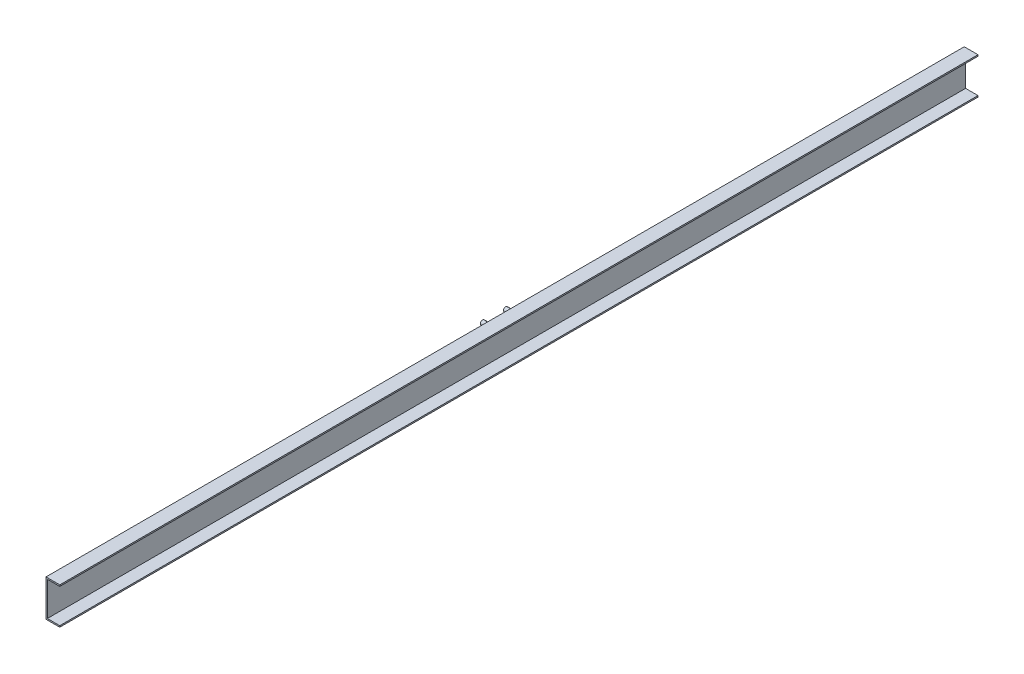
ISO-10303-21;
HEADER;
FILE_DESCRIPTION(('STEP AP214'),'2;1');
FILE_NAME('part.step','',(''),(''),'','','');
FILE_SCHEMA(('AUTOMOTIVE_DESIGN { 1 0 10303 214 1 1 1 1 }'));
ENDSEC;
DATA;
#1=APPLICATION_CONTEXT('core data for automotive mechanical design processes');
#2=APPLICATION_PROTOCOL_DEFINITION('international standard','automotive_design',2000,#1);
#3=PRODUCT_CONTEXT('',#1,'mechanical');
#4=PRODUCT('Part','Part','',(#3));
#5=PRODUCT_RELATED_PRODUCT_CATEGORY('part','',(#4));
#6=PRODUCT_DEFINITION_FORMATION('','',#4);
#7=PRODUCT_DEFINITION_CONTEXT('part definition',#1,'design');
#8=PRODUCT_DEFINITION('design','',#6,#7);
#9=PRODUCT_DEFINITION_SHAPE('','',#8);
#10=(LENGTH_UNIT() NAMED_UNIT(*) SI_UNIT(.MILLI.,.METRE.));
#11=(NAMED_UNIT(*) PLANE_ANGLE_UNIT() SI_UNIT($,.RADIAN.));
#12=(NAMED_UNIT(*) SI_UNIT($,.STERADIAN.) SOLID_ANGLE_UNIT());
#13=UNCERTAINTY_MEASURE_WITH_UNIT(LENGTH_MEASURE(1.E-05),#10,'distance_accuracy_value','');
#14=(GEOMETRIC_REPRESENTATION_CONTEXT(3) GLOBAL_UNCERTAINTY_ASSIGNED_CONTEXT((#13)) GLOBAL_UNIT_ASSIGNED_CONTEXT((#10,
#11,#12)) REPRESENTATION_CONTEXT('',''));
#15=CARTESIAN_POINT('',(0.,0.,0.));
#16=DIRECTION('',(0.,0.,1.));
#17=DIRECTION('',(1.,0.,0.));
#18=AXIS2_PLACEMENT_3D('',#15,#16,#17);
#19=CARTESIAN_POINT('',(0.,0.,3500.));
#20=DIRECTION('',(0.,1.,0.));
#21=DIRECTION('',(0.,0.,1.));
#22=AXIS2_PLACEMENT_3D('',#19,#20,#21);
#23=PLANE('',#22);
#24=DIRECTION('',(0.,0.,-1.));
#25=VECTOR('',#24,1.);
#26=CARTESIAN_POINT('',(30.,0.,3500.));
#27=LINE('',#26,#25);
#28=CARTESIAN_POINT('',(30.,0.,2750.));
#29=VERTEX_POINT('',#28);
#30=CARTESIAN_POINT('',(30.,0.,750.));
#31=VERTEX_POINT('',#30);
#32=EDGE_CURVE('E101',#29,#31,#27,.T.);
#33=ORIENTED_EDGE('',*,*,#32,.F.);
#34=DIRECTION('',(-1.,0.,0.));
#35=VECTOR('',#34,1.);
#36=CARTESIAN_POINT('',(0.,0.,2750.));
#37=LINE('',#36,#35);
#38=CARTESIAN_POINT('',(0.,0.,2750.));
#39=VERTEX_POINT('',#38);
#40=EDGE_CURVE('E96',#29,#39,#37,.T.);
#41=ORIENTED_EDGE('',*,*,#40,.T.);
#42=DIRECTION('',(0.,0.,-1.));
#43=VECTOR('',#42,1.);
#44=CARTESIAN_POINT('',(0.,0.,3500.));
#45=LINE('',#44,#43);
#46=CARTESIAN_POINT('',(0.,0.,750.));
#47=VERTEX_POINT('',#46);
#48=EDGE_CURVE('E54',#39,#47,#45,.T.);
#49=ORIENTED_EDGE('',*,*,#48,.T.);
#50=DIRECTION('',(1.,0.,0.));
#51=VECTOR('',#50,1.);
#52=CARTESIAN_POINT('',(0.,0.,750.));
#53=LINE('',#52,#51);
#54=EDGE_CURVE('E136',#47,#31,#53,.T.);
#55=ORIENTED_EDGE('',*,*,#54,.T.);
#56=EDGE_LOOP('',(#33,#41,#49,#55));
#57=FACE_BOUND('',#56,.T.);
#58=ADVANCED_FACE('F33',(#57),#23,.F.);
#59=CARTESIAN_POINT('',(30.,3.,3500.));
#60=DIRECTION('',(-1.,0.,0.));
#61=DIRECTION('',(0.,0.,1.));
#62=AXIS2_PLACEMENT_3D('',#59,#60,#61);
#63=PLANE('',#62);
#64=DIRECTION('',(0.,0.,-1.));
#65=VECTOR('',#64,1.);
#66=CARTESIAN_POINT('',(30.,3.,3500.));
#67=LINE('',#66,#65);
#68=CARTESIAN_POINT('',(30.,3.,2750.));
#69=VERTEX_POINT('',#68);
#70=CARTESIAN_POINT('',(30.,3.,750.));
#71=VERTEX_POINT('',#70);
#72=EDGE_CURVE('E125',#69,#71,#67,.T.);
#73=ORIENTED_EDGE('',*,*,#72,.F.);
#74=DIRECTION('',(0.,-1.,0.));
#75=VECTOR('',#74,1.);
#76=CARTESIAN_POINT('',(30.,3.,2750.));
#77=LINE('',#76,#75);
#78=EDGE_CURVE('E103',#69,#29,#77,.T.);
#79=ORIENTED_EDGE('',*,*,#78,.T.);
#80=ORIENTED_EDGE('',*,*,#32,.T.);
#81=DIRECTION('',(0.,1.,0.));
#82=VECTOR('',#81,1.);
#83=CARTESIAN_POINT('',(30.,3.,750.));
#84=LINE('',#83,#82);
#85=EDGE_CURVE('E132',#31,#71,#84,.T.);
#86=ORIENTED_EDGE('',*,*,#85,.T.);
#87=EDGE_LOOP('',(#73,#79,#80,#86));
#88=FACE_BOUND('',#87,.T.);
#89=ADVANCED_FACE('F131',(#88),#63,.F.);
#90=CARTESIAN_POINT('',(3.,3.,3500.));
#91=DIRECTION('',(0.,-1.,0.));
#92=DIRECTION('',(0.,0.,-1.));
#93=AXIS2_PLACEMENT_3D('',#90,#91,#92);
#94=PLANE('',#93);
#95=DIRECTION('',(0.,0.,-1.));
#96=VECTOR('',#95,1.);
#97=CARTESIAN_POINT('',(3.,3.,3500.));
#98=LINE('',#97,#96);
#99=CARTESIAN_POINT('',(3.,3.,2750.));
#100=VERTEX_POINT('',#99);
#101=CARTESIAN_POINT('',(3.,3.,750.));
#102=VERTEX_POINT('',#101);
#103=EDGE_CURVE('E123',#100,#102,#98,.T.);
#104=ORIENTED_EDGE('',*,*,#103,.F.);
#105=DIRECTION('',(1.,0.,0.));
#106=VECTOR('',#105,1.);
#107=CARTESIAN_POINT('',(3.,3.,2750.));
#108=LINE('',#107,#106);
#109=EDGE_CURVE('E364',#100,#69,#108,.T.);
#110=ORIENTED_EDGE('',*,*,#109,.T.);
#111=ORIENTED_EDGE('',*,*,#72,.T.);
#112=DIRECTION('',(-1.,0.,0.));
#113=VECTOR('',#112,1.);
#114=CARTESIAN_POINT('',(3.,3.,750.));
#115=LINE('',#114,#113);
#116=EDGE_CURVE('E139',#71,#102,#115,.T.);
#117=ORIENTED_EDGE('',*,*,#116,.T.);
#118=EDGE_LOOP('',(#104,#110,#111,#117));
#119=FACE_BOUND('',#118,.T.);
#120=ADVANCED_FACE('F186',(#119),#94,.F.);
#121=CARTESIAN_POINT('',(3.,3.,3500.));
#122=DIRECTION('',(-1.,0.,0.));
#123=DIRECTION('',(0.,0.,1.));
#124=AXIS2_PLACEMENT_3D('',#121,#122,#123);
#125=PLANE('',#124);
#126=DIRECTION('',(0.,0.,-1.));
#127=VECTOR('',#126,1.);
#128=CARTESIAN_POINT('',(3.,77.,3500.));
#129=LINE('',#128,#127);
#130=CARTESIAN_POINT('',(3.,77.,2750.));
#131=VERTEX_POINT('',#130);
#132=CARTESIAN_POINT('',(3.,77.,750.));
#133=VERTEX_POINT('',#132);
#134=EDGE_CURVE('E121',#131,#133,#129,.T.);
#135=ORIENTED_EDGE('',*,*,#134,.F.);
#136=DIRECTION('',(0.,-1.,0.));
#137=VECTOR('',#136,1.);
#138=CARTESIAN_POINT('',(3.,3.,2750.));
#139=LINE('',#138,#137);
#140=EDGE_CURVE('E366',#131,#100,#139,.T.);
#141=ORIENTED_EDGE('',*,*,#140,.T.);
#142=ORIENTED_EDGE('',*,*,#103,.T.);
#143=DIRECTION('',(0.,1.,0.));
#144=VECTOR('',#143,1.);
#145=CARTESIAN_POINT('',(3.,3.,750.));
#146=LINE('',#145,#144);
#147=EDGE_CURVE('E358',#102,#133,#146,.T.);
#148=ORIENTED_EDGE('',*,*,#147,.T.);
#149=EDGE_LOOP('',(#135,#141,#142,#148));
#150=FACE_BOUND('',#149,.T.);
#151=ADVANCED_FACE('F190',(#150),#125,.F.);
#152=CARTESIAN_POINT('',(3.,77.,3500.));
#153=DIRECTION('',(0.,1.,0.));
#154=DIRECTION('',(0.,0.,1.));
#155=AXIS2_PLACEMENT_3D('',#152,#153,#154);
#156=PLANE('',#155);
#157=DIRECTION('',(0.,0.,-1.));
#158=VECTOR('',#157,1.);
#159=CARTESIAN_POINT('',(30.,77.,3500.));
#160=LINE('',#159,#158);
#161=CARTESIAN_POINT('',(30.,77.,2750.));
#162=VERTEX_POINT('',#161);
#163=CARTESIAN_POINT('',(30.,77.,750.));
#164=VERTEX_POINT('',#163);
#165=EDGE_CURVE('E119',#162,#164,#160,.T.);
#166=ORIENTED_EDGE('',*,*,#165,.F.);
#167=DIRECTION('',(-1.,0.,0.));
#168=VECTOR('',#167,1.);
#169=CARTESIAN_POINT('',(3.,77.,2750.));
#170=LINE('',#169,#168);
#171=EDGE_CURVE('E369',#162,#131,#170,.T.);
#172=ORIENTED_EDGE('',*,*,#171,.T.);
#173=ORIENTED_EDGE('',*,*,#134,.T.);
#174=DIRECTION('',(1.,0.,0.));
#175=VECTOR('',#174,1.);
#176=CARTESIAN_POINT('',(3.,77.,750.));
#177=LINE('',#176,#175);
#178=EDGE_CURVE('E356',#133,#164,#177,.T.);
#179=ORIENTED_EDGE('',*,*,#178,.T.);
#180=EDGE_LOOP('',(#166,#172,#173,#179));
#181=FACE_BOUND('',#180,.T.);
#182=ADVANCED_FACE('F196',(#181),#156,.F.);
#183=CARTESIAN_POINT('',(30.,77.,3500.));
#184=DIRECTION('',(-1.,0.,0.));
#185=DIRECTION('',(0.,0.,1.));
#186=AXIS2_PLACEMENT_3D('',#183,#184,#185);
#187=PLANE('',#186);
#188=DIRECTION('',(0.,0.,-1.));
#189=VECTOR('',#188,1.);
#190=CARTESIAN_POINT('',(30.,80.,3500.));
#191=LINE('',#190,#189);
#192=CARTESIAN_POINT('',(30.,80.,2750.));
#193=VERTEX_POINT('',#192);
#194=CARTESIAN_POINT('',(30.,80.,750.));
#195=VERTEX_POINT('',#194);
#196=EDGE_CURVE('E111',#193,#195,#191,.T.);
#197=ORIENTED_EDGE('',*,*,#196,.F.);
#198=DIRECTION('',(0.,-1.,0.));
#199=VECTOR('',#198,1.);
#200=CARTESIAN_POINT('',(30.,77.,2750.));
#201=LINE('',#200,#199);
#202=EDGE_CURVE('E374',#193,#162,#201,.T.);
#203=ORIENTED_EDGE('',*,*,#202,.T.);
#204=ORIENTED_EDGE('',*,*,#165,.T.);
#205=DIRECTION('',(0.,1.,0.));
#206=VECTOR('',#205,1.);
#207=CARTESIAN_POINT('',(30.,77.,750.));
#208=LINE('',#207,#206);
#209=EDGE_CURVE('E351',#164,#195,#208,.T.);
#210=ORIENTED_EDGE('',*,*,#209,.T.);
#211=EDGE_LOOP('',(#197,#203,#204,#210));
#212=FACE_BOUND('',#211,.T.);
#213=ADVANCED_FACE('F200',(#212),#187,.F.);
#214=CARTESIAN_POINT('',(0.,80.,3500.));
#215=DIRECTION('',(0.,-1.,0.));
#216=DIRECTION('',(0.,0.,-1.));
#217=AXIS2_PLACEMENT_3D('',#214,#215,#216);
#218=PLANE('',#217);
#219=DIRECTION('',(0.,0.,-1.));
#220=VECTOR('',#219,1.);
#221=CARTESIAN_POINT('',(0.,80.,3500.));
#222=LINE('',#221,#220);
#223=CARTESIAN_POINT('',(0.,80.,2750.));
#224=VERTEX_POINT('',#223);
#225=CARTESIAN_POINT('',(0.,80.,750.));
#226=VERTEX_POINT('',#225);
#227=EDGE_CURVE('E108',#224,#226,#222,.T.);
#228=ORIENTED_EDGE('',*,*,#227,.F.);
#229=DIRECTION('',(1.,0.,0.));
#230=VECTOR('',#229,1.);
#231=CARTESIAN_POINT('',(0.,80.,2750.));
#232=LINE('',#231,#230);
#233=EDGE_CURVE('E47',#224,#193,#232,.T.);
#234=ORIENTED_EDGE('',*,*,#233,.T.);
#235=ORIENTED_EDGE('',*,*,#196,.T.);
#236=DIRECTION('',(-1.,0.,0.));
#237=VECTOR('',#236,1.);
#238=CARTESIAN_POINT('',(0.,80.,750.));
#239=LINE('',#238,#237);
#240=EDGE_CURVE('E102',#195,#226,#239,.T.);
#241=ORIENTED_EDGE('',*,*,#240,.T.);
#242=EDGE_LOOP('',(#228,#234,#235,#241));
#243=FACE_BOUND('',#242,.T.);
#244=ADVANCED_FACE('F204',(#243),#218,.F.);
#245=CARTESIAN_POINT('',(0.,0.,3500.));
#246=DIRECTION('',(1.,0.,0.));
#247=DIRECTION('',(0.,0.,-1.));
#248=AXIS2_PLACEMENT_3D('',#245,#246,#247);
#249=PLANE('',#248);
#250=CARTESIAN_POINT('',(0.,60.4539940488329,1775.));
#251=DIRECTION('',(1.,0.,0.));
#252=DIRECTION('',(0.,0.,-1.));
#253=AXIS2_PLACEMENT_3D('',#250,#251,#252);
#254=CIRCLE('',#253,4.85898955020445);
#255=CARTESIAN_POINT('',(0.,60.4539940488329,1770.1410104498));
#256=VERTEX_POINT('',#255);
#257=EDGE_CURVE('E141',#256,#256,#254,.T.);
#258=ORIENTED_EDGE('',*,*,#257,.T.);
#259=EDGE_LOOP('',(#258));
#260=FACE_BOUND('',#259,.T.);
#261=CARTESIAN_POINT('',(0.,20.1513313496111,1775.));
#262=DIRECTION('',(1.,0.,0.));
#263=DIRECTION('',(0.,0.,1.));
#264=AXIS2_PLACEMENT_3D('',#261,#262,#263);
#265=CIRCLE('',#264,4.85898955020445);
#266=CARTESIAN_POINT('',(0.,20.1513313496111,1779.8589895502));
#267=VERTEX_POINT('',#266);
#268=EDGE_CURVE('E149',#267,#267,#265,.T.);
#269=ORIENTED_EDGE('',*,*,#268,.T.);
#270=EDGE_LOOP('',(#269));
#271=FACE_BOUND('',#270,.T.);
#272=CARTESIAN_POINT('',(0.,60.4539940488329,1725.));
#273=DIRECTION('',(1.,0.,0.));
#274=DIRECTION('',(0.,0.,1.));
#275=AXIS2_PLACEMENT_3D('',#272,#273,#274);
#276=CIRCLE('',#275,4.85898955020445);
#277=CARTESIAN_POINT('',(0.,60.4539940488329,1729.8589895502));
#278=VERTEX_POINT('',#277);
#279=EDGE_CURVE('E154',#278,#278,#276,.T.);
#280=ORIENTED_EDGE('',*,*,#279,.T.);
#281=EDGE_LOOP('',(#280));
#282=FACE_BOUND('',#281,.T.);
#283=CARTESIAN_POINT('',(0.,20.1513313496111,1725.));
#284=DIRECTION('',(1.,0.,0.));
#285=DIRECTION('',(0.,0.,-1.));
#286=AXIS2_PLACEMENT_3D('',#283,#284,#285);
#287=CIRCLE('',#286,4.85898955020445);
#288=CARTESIAN_POINT('',(0.,20.1513313496111,1720.1410104498));
#289=VERTEX_POINT('',#288);
#290=EDGE_CURVE('E114',#289,#289,#287,.T.);
#291=ORIENTED_EDGE('',*,*,#290,.T.);
#292=EDGE_LOOP('',(#291));
#293=FACE_BOUND('',#292,.T.);
#294=ORIENTED_EDGE('',*,*,#48,.F.);
#295=DIRECTION('',(0.,1.,0.));
#296=VECTOR('',#295,1.);
#297=CARTESIAN_POINT('',(0.,0.,2750.));
#298=LINE('',#297,#296);
#299=EDGE_CURVE('E11',#39,#224,#298,.T.);
#300=ORIENTED_EDGE('',*,*,#299,.T.);
#301=ORIENTED_EDGE('',*,*,#227,.T.);
#302=DIRECTION('',(0.,-1.,0.));
#303=VECTOR('',#302,1.);
#304=CARTESIAN_POINT('',(0.,0.,750.));
#305=LINE('',#304,#303);
#306=EDGE_CURVE('E40',#226,#47,#305,.T.);
#307=ORIENTED_EDGE('',*,*,#306,.T.);
#308=EDGE_LOOP('',(#294,#300,#301,#307));
#309=FACE_BOUND('',#308,.T.);
#310=ADVANCED_FACE('F106',(#260,#271,#282,#293,#309),#249,.F.);
#311=CARTESIAN_POINT('',(-24.,20.1513313496111,1725.));
#312=DIRECTION('',(1.,0.,0.));
#313=DIRECTION('',(0.,0.,-1.));
#314=AXIS2_PLACEMENT_3D('',#311,#312,#313);
#315=CYLINDRICAL_SURFACE('',#314,4.85898955020445);
#316=CARTESIAN_POINT('',(-24.,20.1513313496111,1725.));
#317=DIRECTION('',(1.,0.,0.));
#318=DIRECTION('',(0.,0.,-1.));
#319=AXIS2_PLACEMENT_3D('',#316,#317,#318);
#320=CIRCLE('',#319,4.85898955020445);
#321=CARTESIAN_POINT('',(-24.,20.1513313496111,1720.1410104498));
#322=VERTEX_POINT('',#321);
#323=EDGE_CURVE('E109',#322,#322,#320,.T.);
#324=ORIENTED_EDGE('',*,*,#323,.T.);
#325=EDGE_LOOP('',(#324));
#326=FACE_BOUND('',#325,.T.);
#327=ORIENTED_EDGE('',*,*,#290,.F.);
#328=EDGE_LOOP('',(#327));
#329=FACE_BOUND('',#328,.T.);
#330=ADVANCED_FACE('F178',(#326,#329),#315,.T.);
#331=CARTESIAN_POINT('',(-24.,20.1513313496111,1725.));
#332=DIRECTION('',(1.,0.,0.));
#333=DIRECTION('',(0.,0.,-1.));
#334=AXIS2_PLACEMENT_3D('',#331,#332,#333);
#335=PLANE('',#334);
#336=ORIENTED_EDGE('',*,*,#323,.F.);
#337=EDGE_LOOP('',(#336));
#338=FACE_BOUND('',#337,.T.);
#339=ADVANCED_FACE('F168',(#338),#335,.F.);
#340=CARTESIAN_POINT('',(-24.,60.4539940488329,1725.));
#341=DIRECTION('',(1.,0.,0.));
#342=DIRECTION('',(0.,0.,-1.));
#343=AXIS2_PLACEMENT_3D('',#340,#341,#342);
#344=CYLINDRICAL_SURFACE('',#343,4.85898955020445);
#345=CARTESIAN_POINT('',(-24.,60.4539940488329,1725.));
#346=DIRECTION('',(1.,0.,0.));
#347=DIRECTION('',(0.,0.,1.));
#348=AXIS2_PLACEMENT_3D('',#345,#346,#347);
#349=CIRCLE('',#348,4.85898955020445);
#350=CARTESIAN_POINT('',(-24.,60.4539940488329,1729.8589895502));
#351=VERTEX_POINT('',#350);
#352=EDGE_CURVE('E157',#351,#351,#349,.T.);
#353=ORIENTED_EDGE('',*,*,#352,.T.);
#354=EDGE_LOOP('',(#353));
#355=FACE_BOUND('',#354,.T.);
#356=ORIENTED_EDGE('',*,*,#279,.F.);
#357=EDGE_LOOP('',(#356));
#358=FACE_BOUND('',#357,.T.);
#359=ADVANCED_FACE('F165',(#355,#358),#344,.T.);
#360=CARTESIAN_POINT('',(-24.,60.4539940488329,1725.));
#361=DIRECTION('',(-1.,0.,0.));
#362=DIRECTION('',(0.,0.,1.));
#363=AXIS2_PLACEMENT_3D('',#360,#361,#362);
#364=PLANE('',#363);
#365=ORIENTED_EDGE('',*,*,#352,.F.);
#366=EDGE_LOOP('',(#365));
#367=FACE_BOUND('',#366,.T.);
#368=ADVANCED_FACE('F167',(#367),#364,.T.);
#369=CARTESIAN_POINT('',(-24.,20.1513313496111,1775.));
#370=DIRECTION('',(1.,0.,0.));
#371=DIRECTION('',(0.,0.,-1.));
#372=AXIS2_PLACEMENT_3D('',#369,#370,#371);
#373=CYLINDRICAL_SURFACE('',#372,4.85898955020445);
#374=CARTESIAN_POINT('',(-24.,20.1513313496111,1775.));
#375=DIRECTION('',(1.,0.,0.));
#376=DIRECTION('',(0.,0.,1.));
#377=AXIS2_PLACEMENT_3D('',#374,#375,#376);
#378=CIRCLE('',#377,4.85898955020445);
#379=CARTESIAN_POINT('',(-24.,20.1513313496111,1779.8589895502));
#380=VERTEX_POINT('',#379);
#381=EDGE_CURVE('E151',#380,#380,#378,.T.);
#382=ORIENTED_EDGE('',*,*,#381,.T.);
#383=EDGE_LOOP('',(#382));
#384=FACE_BOUND('',#383,.T.);
#385=ORIENTED_EDGE('',*,*,#268,.F.);
#386=EDGE_LOOP('',(#385));
#387=FACE_BOUND('',#386,.T.);
#388=ADVANCED_FACE('F175',(#384,#387),#373,.T.);
#389=CARTESIAN_POINT('',(-24.,20.1513313496111,1775.));
#390=DIRECTION('',(-1.,0.,0.));
#391=DIRECTION('',(0.,0.,1.));
#392=AXIS2_PLACEMENT_3D('',#389,#390,#391);
#393=PLANE('',#392);
#394=ORIENTED_EDGE('',*,*,#381,.F.);
#395=EDGE_LOOP('',(#394));
#396=FACE_BOUND('',#395,.T.);
#397=ADVANCED_FACE('F247',(#396),#393,.T.);
#398=CARTESIAN_POINT('',(-24.,60.4539940488329,1775.));
#399=DIRECTION('',(1.,0.,0.));
#400=DIRECTION('',(0.,0.,-1.));
#401=AXIS2_PLACEMENT_3D('',#398,#399,#400);
#402=CYLINDRICAL_SURFACE('',#401,4.85898955020445);
#403=CARTESIAN_POINT('',(-24.,60.4539940488329,1775.));
#404=DIRECTION('',(1.,0.,0.));
#405=DIRECTION('',(0.,0.,-1.));
#406=AXIS2_PLACEMENT_3D('',#403,#404,#405);
#407=CIRCLE('',#406,4.85898955020445);
#408=CARTESIAN_POINT('',(-24.,60.4539940488329,1770.1410104498));
#409=VERTEX_POINT('',#408);
#410=EDGE_CURVE('E144',#409,#409,#407,.T.);
#411=ORIENTED_EDGE('',*,*,#410,.T.);
#412=EDGE_LOOP('',(#411));
#413=FACE_BOUND('',#412,.T.);
#414=ORIENTED_EDGE('',*,*,#257,.F.);
#415=EDGE_LOOP('',(#414));
#416=FACE_BOUND('',#415,.T.);
#417=ADVANCED_FACE('F257',(#413,#416),#402,.T.);
#418=CARTESIAN_POINT('',(-24.,60.4539940488329,1775.));
#419=DIRECTION('',(1.,0.,0.));
#420=DIRECTION('',(0.,0.,-1.));
#421=AXIS2_PLACEMENT_3D('',#418,#419,#420);
#422=PLANE('',#421);
#423=ORIENTED_EDGE('',*,*,#410,.F.);
#424=EDGE_LOOP('',(#423));
#425=FACE_BOUND('',#424,.T.);
#426=ADVANCED_FACE('F267',(#425),#422,.F.);
#427=CARTESIAN_POINT('',(0.,0.,750.));
#428=DIRECTION('',(0.,0.,1.));
#429=DIRECTION('',(1.,0.,0.));
#430=AXIS2_PLACEMENT_3D('',#427,#428,#429);
#431=PLANE('',#430);
#432=ORIENTED_EDGE('',*,*,#306,.F.);
#433=ORIENTED_EDGE('',*,*,#240,.F.);
#434=ORIENTED_EDGE('',*,*,#209,.F.);
#435=ORIENTED_EDGE('',*,*,#178,.F.);
#436=ORIENTED_EDGE('',*,*,#147,.F.);
#437=ORIENTED_EDGE('',*,*,#116,.F.);
#438=ORIENTED_EDGE('',*,*,#85,.F.);
#439=ORIENTED_EDGE('',*,*,#54,.F.);
#440=EDGE_LOOP('',(#432,#433,#434,#435,#436,#437,#438,#439));
#441=FACE_BOUND('',#440,.T.);
#442=ADVANCED_FACE('F135',(#441),#431,.F.);
#443=CARTESIAN_POINT('',(0.,0.,2750.));
#444=DIRECTION('',(0.,0.,-1.));
#445=DIRECTION('',(-1.,0.,0.));
#446=AXIS2_PLACEMENT_3D('',#443,#444,#445);
#447=PLANE('',#446);
#448=ORIENTED_EDGE('',*,*,#78,.F.);
#449=ORIENTED_EDGE('',*,*,#109,.F.);
#450=ORIENTED_EDGE('',*,*,#140,.F.);
#451=ORIENTED_EDGE('',*,*,#171,.F.);
#452=ORIENTED_EDGE('',*,*,#202,.F.);
#453=ORIENTED_EDGE('',*,*,#233,.F.);
#454=ORIENTED_EDGE('',*,*,#299,.F.);
#455=ORIENTED_EDGE('',*,*,#40,.F.);
#456=EDGE_LOOP('',(#448,#449,#450,#451,#452,#453,#454,#455));
#457=FACE_BOUND('',#456,.T.);
#458=ADVANCED_FACE('F95',(#457),#447,.F.);
#459=CLOSED_SHELL('',(#58,#89,#120,#151,#182,#213,#244,#310,#330,#339,#359,#368,#388,#397,#417,
#426,#442,#458));
#460=MANIFOLD_SOLID_BREP('B2',#459);
#461=ADVANCED_BREP_SHAPE_REPRESENTATION('',(#18,#460),#14);
#462=SHAPE_DEFINITION_REPRESENTATION(#9,#461);
ENDSEC;
END-ISO-10303-21;
